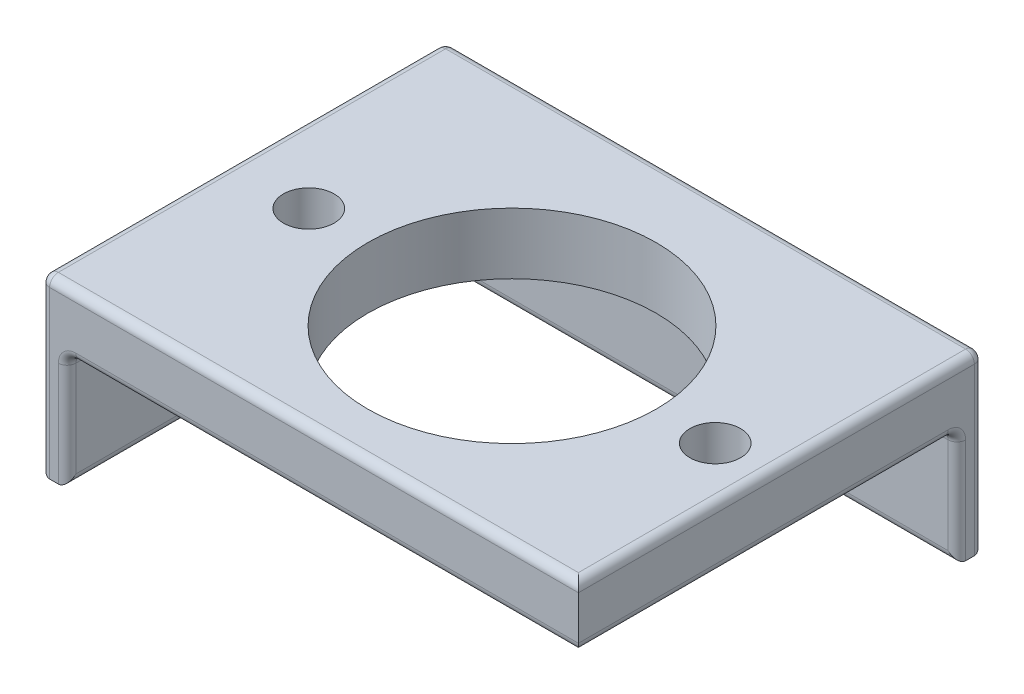
ISO-10303-21;
HEADER;
FILE_DESCRIPTION(('STEP AP214'),'2;1');
FILE_NAME('part.step','',(''),(''),'','','');
FILE_SCHEMA(('AUTOMOTIVE_DESIGN { 1 0 10303 214 1 1 1 1 }'));
ENDSEC;
DATA;
#1=APPLICATION_CONTEXT('core data for automotive mechanical design processes');
#2=APPLICATION_PROTOCOL_DEFINITION('international standard','automotive_design',2000,#1);
#3=PRODUCT_CONTEXT('',#1,'mechanical');
#4=PRODUCT('Part','Part','',(#3));
#5=PRODUCT_RELATED_PRODUCT_CATEGORY('part','',(#4));
#6=PRODUCT_DEFINITION_FORMATION('','',#4);
#7=PRODUCT_DEFINITION_CONTEXT('part definition',#1,'design');
#8=PRODUCT_DEFINITION('design','',#6,#7);
#9=PRODUCT_DEFINITION_SHAPE('','',#8);
#10=(LENGTH_UNIT() NAMED_UNIT(*) SI_UNIT(.MILLI.,.METRE.));
#11=(NAMED_UNIT(*) PLANE_ANGLE_UNIT() SI_UNIT($,.RADIAN.));
#12=(NAMED_UNIT(*) SI_UNIT($,.STERADIAN.) SOLID_ANGLE_UNIT());
#13=UNCERTAINTY_MEASURE_WITH_UNIT(LENGTH_MEASURE(1.E-05),#10,'distance_accuracy_value','');
#14=(GEOMETRIC_REPRESENTATION_CONTEXT(3) GLOBAL_UNCERTAINTY_ASSIGNED_CONTEXT((#13)) GLOBAL_UNIT_ASSIGNED_CONTEXT((#10,
#11,#12)) REPRESENTATION_CONTEXT('',''));
#15=CARTESIAN_POINT('',(0.,0.,0.));
#16=DIRECTION('',(0.,0.,1.));
#17=DIRECTION('',(1.,0.,0.));
#18=AXIS2_PLACEMENT_3D('',#15,#16,#17);
#19=CARTESIAN_POINT('',(-29.25,0.,0.));
#20=DIRECTION('',(-1.,0.,0.));
#21=DIRECTION('',(0.,0.,1.));
#22=AXIS2_PLACEMENT_3D('',#19,#20,#21);
#23=PLANE('',#22);
#24=DIRECTION('',(0.,1.,0.));
#25=VECTOR('',#24,1.);
#26=CARTESIAN_POINT('',(-29.25,0.,20.65));
#27=LINE('',#26,#25);
#28=CARTESIAN_POINT('',(-29.25,-1.,20.65));
#29=VERTEX_POINT('',#28);
#30=CARTESIAN_POINT('',(-29.25,-11.98,20.65));
#31=VERTEX_POINT('',#30);
#32=EDGE_CURVE('E387',#29,#31,#27,.F.);
#33=ORIENTED_EDGE('',*,*,#32,.T.);
#34=DIRECTION('',(0.,0.,1.));
#35=VECTOR('',#34,1.);
#36=CARTESIAN_POINT('',(-29.25,-11.98,0.));
#37=LINE('',#36,#35);
#38=CARTESIAN_POINT('',(-29.25,-11.98,-20.65));
#39=VERTEX_POINT('',#38);
#40=EDGE_CURVE('E209',#31,#39,#37,.F.);
#41=ORIENTED_EDGE('',*,*,#40,.T.);
#42=DIRECTION('',(0.,1.,0.));
#43=VECTOR('',#42,1.);
#44=CARTESIAN_POINT('',(-29.25,0.,-20.65));
#45=LINE('',#44,#43);
#46=CARTESIAN_POINT('',(-29.25,-1.,-20.65));
#47=VERTEX_POINT('',#46);
#48=EDGE_CURVE('E384',#39,#47,#45,.T.);
#49=ORIENTED_EDGE('',*,*,#48,.T.);
#50=DIRECTION('',(0.,0.,1.));
#51=VECTOR('',#50,1.);
#52=CARTESIAN_POINT('',(-29.25,-1.,21.65));
#53=LINE('',#52,#51);
#54=EDGE_CURVE('E386',#47,#29,#53,.T.);
#55=ORIENTED_EDGE('',*,*,#54,.T.);
#56=EDGE_LOOP('',(#33,#41,#49,#55));
#57=FACE_BOUND('',#56,.T.);
#58=CARTESIAN_POINT('',(-29.25,-4.79,-11.65));
#59=DIRECTION('',(1.,0.,0.));
#60=DIRECTION('',(0.,0.,-1.));
#61=AXIS2_PLACEMENT_3D('',#58,#59,#60);
#62=CIRCLE('',#61,2.74999999999999);
#63=CARTESIAN_POINT('',(-29.25,-4.79,-14.4));
#64=VERTEX_POINT('',#63);
#65=EDGE_CURVE('E444',#64,#64,#62,.T.);
#66=ORIENTED_EDGE('',*,*,#65,.F.);
#67=EDGE_LOOP('',(#66));
#68=FACE_BOUND('',#67,.T.);
#69=CARTESIAN_POINT('',(-29.25,-4.79,11.65));
#70=DIRECTION('',(1.,0.,0.));
#71=DIRECTION('',(0.,0.,-1.));
#72=AXIS2_PLACEMENT_3D('',#69,#70,#71);
#73=CIRCLE('',#72,2.74999999999999);
#74=CARTESIAN_POINT('',(-29.25,-4.79,8.90000000000001));
#75=VERTEX_POINT('',#74);
#76=EDGE_CURVE('E238',#75,#75,#73,.T.);
#77=ORIENTED_EDGE('',*,*,#76,.F.);
#78=EDGE_LOOP('',(#77));
#79=FACE_BOUND('',#78,.T.);
#80=ADVANCED_FACE('F39',(#57,#68,#79),#23,.F.);
#81=CARTESIAN_POINT('',(0.,7.,0.));
#82=DIRECTION('',(0.,1.,0.));
#83=DIRECTION('',(0.,0.,1.));
#84=AXIS2_PLACEMENT_3D('',#81,#82,#83);
#85=PLANE('',#84);
#86=DIRECTION('',(0.,0.,-1.));
#87=VECTOR('',#86,1.);
#88=CARTESIAN_POINT('',(28.25,7.,-24.65));
#89=LINE('',#88,#87);
#90=CARTESIAN_POINT('',(28.25,7.,20.65));
#91=VERTEX_POINT('',#90);
#92=CARTESIAN_POINT('',(28.25,7.,-23.65));
#93=VERTEX_POINT('',#92);
#94=EDGE_CURVE('E253',#91,#93,#89,.T.);
#95=ORIENTED_EDGE('',*,*,#94,.T.);
#96=DIRECTION('',(1.,0.,0.));
#97=VECTOR('',#96,1.);
#98=CARTESIAN_POINT('',(-32.25,7.,-23.65));
#99=LINE('',#98,#97);
#100=CARTESIAN_POINT('',(-31.25,7.,-23.65));
#101=VERTEX_POINT('',#100);
#102=EDGE_CURVE('E259',#93,#101,#99,.F.);
#103=ORIENTED_EDGE('',*,*,#102,.T.);
#104=DIRECTION('',(0.,0.,-1.));
#105=VECTOR('',#104,1.);
#106=CARTESIAN_POINT('',(-31.25,7.,0.));
#107=LINE('',#106,#105);
#108=CARTESIAN_POINT('',(-31.25,7.,20.65));
#109=VERTEX_POINT('',#108);
#110=EDGE_CURVE('E257',#101,#109,#107,.F.);
#111=ORIENTED_EDGE('',*,*,#110,.T.);
#112=DIRECTION('',(1.,0.,0.));
#113=VECTOR('',#112,1.);
#114=CARTESIAN_POINT('',(29.25,7.,20.65));
#115=LINE('',#114,#113);
#116=EDGE_CURVE('E255',#109,#91,#115,.T.);
#117=ORIENTED_EDGE('',*,*,#116,.T.);
#118=EDGE_LOOP('',(#95,#103,#111,#117));
#119=FACE_BOUND('',#118,.T.);
#120=CARTESIAN_POINT('',(-23.25,7.,0.));
#121=DIRECTION('',(0.,1.,0.));
#122=DIRECTION('',(0.,0.,1.));
#123=AXIS2_PLACEMENT_3D('',#120,#121,#122);
#124=CIRCLE('',#123,2.9);
#125=CARTESIAN_POINT('',(-23.25,7.,2.90000000000001));
#126=VERTEX_POINT('',#125);
#127=EDGE_CURVE('E426',#126,#126,#124,.T.);
#128=ORIENTED_EDGE('',*,*,#127,.F.);
#129=EDGE_LOOP('',(#128));
#130=FACE_BOUND('',#129,.T.);
#131=CARTESIAN_POINT('',(23.25,7.,0.));
#132=DIRECTION('',(0.,1.,0.));
#133=DIRECTION('',(0.,0.,1.));
#134=AXIS2_PLACEMENT_3D('',#131,#132,#133);
#135=CIRCLE('',#134,2.9);
#136=CARTESIAN_POINT('',(23.25,7.,2.9));
#137=VERTEX_POINT('',#136);
#138=EDGE_CURVE('E420',#137,#137,#135,.T.);
#139=ORIENTED_EDGE('',*,*,#138,.F.);
#140=EDGE_LOOP('',(#139));
#141=FACE_BOUND('',#140,.T.);
#142=CARTESIAN_POINT('',(0.,7.,0.));
#143=DIRECTION('',(0.,1.,0.));
#144=DIRECTION('',(0.,0.,1.));
#145=AXIS2_PLACEMENT_3D('',#142,#143,#144);
#146=CIRCLE('',#145,16.5);
#147=CARTESIAN_POINT('',(0.,7.,16.5));
#148=VERTEX_POINT('',#147);
#149=EDGE_CURVE('E411',#148,#148,#146,.T.);
#150=ORIENTED_EDGE('',*,*,#149,.F.);
#151=EDGE_LOOP('',(#150));
#152=FACE_BOUND('',#151,.T.);
#153=ADVANCED_FACE('F457',(#119,#130,#141,#152),#85,.T.);
#154=CARTESIAN_POINT('',(0.,0.,0.));
#155=DIRECTION('',(0.,1.,0.));
#156=DIRECTION('',(0.,0.,1.));
#157=AXIS2_PLACEMENT_3D('',#154,#155,#156);
#158=PLANE('',#157);
#159=DIRECTION('',(-1.,0.,0.));
#160=VECTOR('',#159,1.);
#161=CARTESIAN_POINT('',(0.,0.,-20.65));
#162=LINE('',#161,#160);
#163=CARTESIAN_POINT('',(-28.25,0.,-20.65));
#164=VERTEX_POINT('',#163);
#165=CARTESIAN_POINT('',(28.25,0.,-20.65));
#166=VERTEX_POINT('',#165);
#167=EDGE_CURVE('E355',#164,#166,#162,.F.);
#168=ORIENTED_EDGE('',*,*,#167,.T.);
#169=DIRECTION('',(0.,0.,-1.));
#170=VECTOR('',#169,1.);
#171=CARTESIAN_POINT('',(28.25,0.,0.));
#172=LINE('',#171,#170);
#173=CARTESIAN_POINT('',(28.25,0.,20.65));
#174=VERTEX_POINT('',#173);
#175=EDGE_CURVE('E378',#166,#174,#172,.F.);
#176=ORIENTED_EDGE('',*,*,#175,.T.);
#177=DIRECTION('',(1.,0.,0.));
#178=VECTOR('',#177,1.);
#179=CARTESIAN_POINT('',(0.,0.,20.65));
#180=LINE('',#179,#178);
#181=CARTESIAN_POINT('',(-28.25,0.,20.65));
#182=VERTEX_POINT('',#181);
#183=EDGE_CURVE('E376',#174,#182,#180,.F.);
#184=ORIENTED_EDGE('',*,*,#183,.T.);
#185=DIRECTION('',(0.,0.,1.));
#186=VECTOR('',#185,1.);
#187=CARTESIAN_POINT('',(-28.25,0.,-21.65));
#188=LINE('',#187,#186);
#189=EDGE_CURVE('E374',#182,#164,#188,.F.);
#190=ORIENTED_EDGE('',*,*,#189,.T.);
#191=EDGE_LOOP('',(#168,#176,#184,#190));
#192=FACE_BOUND('',#191,.T.);
#193=CARTESIAN_POINT('',(-23.25,0.,0.));
#194=DIRECTION('',(0.,1.,0.));
#195=DIRECTION('',(0.,0.,1.));
#196=AXIS2_PLACEMENT_3D('',#193,#194,#195);
#197=CIRCLE('',#196,2.9);
#198=CARTESIAN_POINT('',(-23.25,0.,2.9));
#199=VERTEX_POINT('',#198);
#200=EDGE_CURVE('E423',#199,#199,#197,.T.);
#201=ORIENTED_EDGE('',*,*,#200,.T.);
#202=EDGE_LOOP('',(#201));
#203=FACE_BOUND('',#202,.T.);
#204=CARTESIAN_POINT('',(23.25,0.,0.));
#205=DIRECTION('',(0.,1.,0.));
#206=DIRECTION('',(0.,0.,1.));
#207=AXIS2_PLACEMENT_3D('',#204,#205,#206);
#208=CIRCLE('',#207,2.9);
#209=CARTESIAN_POINT('',(23.25,0.,2.9));
#210=VERTEX_POINT('',#209);
#211=EDGE_CURVE('E415',#210,#210,#208,.T.);
#212=ORIENTED_EDGE('',*,*,#211,.T.);
#213=EDGE_LOOP('',(#212));
#214=FACE_BOUND('',#213,.T.);
#215=CARTESIAN_POINT('',(0.,0.,0.));
#216=DIRECTION('',(0.,1.,0.));
#217=DIRECTION('',(0.,0.,1.));
#218=AXIS2_PLACEMENT_3D('',#215,#216,#217);
#219=CIRCLE('',#218,16.5);
#220=CARTESIAN_POINT('',(0.,0.,16.5));
#221=VERTEX_POINT('',#220);
#222=EDGE_CURVE('E412',#221,#221,#219,.T.);
#223=ORIENTED_EDGE('',*,*,#222,.T.);
#224=EDGE_LOOP('',(#223));
#225=FACE_BOUND('',#224,.T.);
#226=ADVANCED_FACE('F462',(#192,#203,#214,#225),#158,.F.);
#227=CARTESIAN_POINT('',(29.25,7.,21.65));
#228=DIRECTION('',(0.,0.,-1.));
#229=DIRECTION('',(-1.,0.,0.));
#230=AXIS2_PLACEMENT_3D('',#227,#228,#229);
#231=PLANE('',#230);
#232=DIRECTION('',(1.,0.,0.));
#233=VECTOR('',#232,1.);
#234=CARTESIAN_POINT('',(-32.25,6.,21.65));
#235=LINE('',#234,#233);
#236=CARTESIAN_POINT('',(29.25,6.,21.65));
#237=VERTEX_POINT('',#236);
#238=CARTESIAN_POINT('',(-31.25,6.,21.65));
#239=VERTEX_POINT('',#238);
#240=EDGE_CURVE('E48',#237,#239,#235,.F.);
#241=ORIENTED_EDGE('',*,*,#240,.T.);
#242=DIRECTION('',(0.,1.,0.));
#243=VECTOR('',#242,1.);
#244=CARTESIAN_POINT('',(-31.25,-12.98,21.65));
#245=LINE('',#244,#243);
#246=CARTESIAN_POINT('',(-31.25,-12.98,21.65));
#247=VERTEX_POINT('',#246);
#248=EDGE_CURVE('E11',#239,#247,#245,.F.);
#249=ORIENTED_EDGE('',*,*,#248,.T.);
#250=DIRECTION('',(1.,0.,0.));
#251=VECTOR('',#250,1.);
#252=CARTESIAN_POINT('',(-32.25,-12.98,21.65));
#253=LINE('',#252,#251);
#254=CARTESIAN_POINT('',(-30.25,-12.98,21.65));
#255=VERTEX_POINT('',#254);
#256=EDGE_CURVE('E172',#247,#255,#253,.T.);
#257=ORIENTED_EDGE('',*,*,#256,.T.);
#258=DIRECTION('',(0.,1.,0.));
#259=VECTOR('',#258,1.);
#260=CARTESIAN_POINT('',(-30.25,7.,21.65));
#261=LINE('',#260,#259);
#262=CARTESIAN_POINT('',(-30.25,-1.,21.65));
#263=VERTEX_POINT('',#262);
#264=EDGE_CURVE('E176',#255,#263,#261,.T.);
#265=ORIENTED_EDGE('',*,*,#264,.T.);
#266=CARTESIAN_POINT('',(-28.25,-1.,21.65));
#267=DIRECTION('',(0.,0.,-1.));
#268=DIRECTION('',(-1.,0.,0.));
#269=AXIS2_PLACEMENT_3D('',#266,#267,#268);
#270=CIRCLE('',#269,2.);
#271=CARTESIAN_POINT('',(-28.25,1.,21.65));
#272=VERTEX_POINT('',#271);
#273=EDGE_CURVE('E205',#272,#263,#270,.F.);
#274=ORIENTED_EDGE('',*,*,#273,.F.);
#275=DIRECTION('',(1.,0.,0.));
#276=VECTOR('',#275,1.);
#277=CARTESIAN_POINT('',(29.25,1.,21.65));
#278=LINE('',#277,#276);
#279=CARTESIAN_POINT('',(29.25,1.,21.65));
#280=VERTEX_POINT('',#279);
#281=EDGE_CURVE('E204',#272,#280,#278,.T.);
#282=ORIENTED_EDGE('',*,*,#281,.T.);
#283=DIRECTION('',(0.,-1.,0.));
#284=VECTOR('',#283,1.);
#285=CARTESIAN_POINT('',(29.25,7.,21.65));
#286=LINE('',#285,#284);
#287=EDGE_CURVE('E193',#237,#280,#286,.T.);
#288=ORIENTED_EDGE('',*,*,#287,.F.);
#289=EDGE_LOOP('',(#241,#249,#257,#265,#274,#282,#288));
#290=FACE_BOUND('',#289,.T.);
#291=ADVANCED_FACE('F174',(#290),#231,.F.);
#292=CARTESIAN_POINT('',(29.25,7.,21.65));
#293=DIRECTION('',(-1.,0.,0.));
#294=DIRECTION('',(0.,0.,1.));
#295=AXIS2_PLACEMENT_3D('',#292,#293,#294);
#296=PLANE('',#295);
#297=DIRECTION('',(0.,0.,1.));
#298=VECTOR('',#297,1.);
#299=CARTESIAN_POINT('',(29.25,-12.98,-24.65));
#300=LINE('',#299,#298);
#301=CARTESIAN_POINT('',(29.25,-12.98,-23.65));
#302=VERTEX_POINT('',#301);
#303=CARTESIAN_POINT('',(29.25,-12.98,-22.65));
#304=VERTEX_POINT('',#303);
#305=EDGE_CURVE('E180',#302,#304,#300,.T.);
#306=ORIENTED_EDGE('',*,*,#305,.F.);
#307=DIRECTION('',(0.,-1.,0.));
#308=VECTOR('',#307,1.);
#309=CARTESIAN_POINT('',(29.25,7.,-23.65));
#310=LINE('',#309,#308);
#311=CARTESIAN_POINT('',(29.25,6.,-23.65));
#312=VERTEX_POINT('',#311);
#313=EDGE_CURVE('E250',#302,#312,#310,.F.);
#314=ORIENTED_EDGE('',*,*,#313,.T.);
#315=DIRECTION('',(0.,0.,-1.));
#316=VECTOR('',#315,1.);
#317=CARTESIAN_POINT('',(29.25,6.,21.65));
#318=LINE('',#317,#316);
#319=EDGE_CURVE('E248',#312,#237,#318,.F.);
#320=ORIENTED_EDGE('',*,*,#319,.T.);
#321=ORIENTED_EDGE('',*,*,#287,.T.);
#322=DIRECTION('',(0.,0.,-1.));
#323=VECTOR('',#322,1.);
#324=CARTESIAN_POINT('',(29.25,1.,21.65));
#325=LINE('',#324,#323);
#326=CARTESIAN_POINT('',(29.25,1.,-20.65));
#327=VERTEX_POINT('',#326);
#328=EDGE_CURVE('E371',#280,#327,#325,.T.);
#329=ORIENTED_EDGE('',*,*,#328,.T.);
#330=CARTESIAN_POINT('',(29.25,-1.,-20.65));
#331=DIRECTION('',(-1.,0.,0.));
#332=DIRECTION('',(0.,0.,1.));
#333=AXIS2_PLACEMENT_3D('',#330,#331,#332);
#334=CIRCLE('',#333,2.);
#335=CARTESIAN_POINT('',(29.25,-1.,-22.65));
#336=VERTEX_POINT('',#335);
#337=EDGE_CURVE('E347',#336,#327,#334,.F.);
#338=ORIENTED_EDGE('',*,*,#337,.F.);
#339=DIRECTION('',(0.,-1.,0.));
#340=VECTOR('',#339,1.);
#341=CARTESIAN_POINT('',(29.25,-12.98,-22.65));
#342=LINE('',#341,#340);
#343=EDGE_CURVE('E343',#336,#304,#342,.T.);
#344=ORIENTED_EDGE('',*,*,#343,.T.);
#345=EDGE_LOOP('',(#306,#314,#320,#321,#329,#338,#344));
#346=FACE_BOUND('',#345,.T.);
#347=ADVANCED_FACE('F487',(#346),#296,.F.);
#348=CARTESIAN_POINT('',(0.,7.,0.));
#349=DIRECTION('',(0.,-1.,0.));
#350=DIRECTION('',(0.,0.,-1.));
#351=AXIS2_PLACEMENT_3D('',#348,#349,#350);
#352=CYLINDRICAL_SURFACE('',#351,16.5);
#353=ORIENTED_EDGE('',*,*,#149,.T.);
#354=EDGE_LOOP('',(#353));
#355=FACE_BOUND('',#354,.T.);
#356=ORIENTED_EDGE('',*,*,#222,.F.);
#357=EDGE_LOOP('',(#356));
#358=FACE_BOUND('',#357,.T.);
#359=ADVANCED_FACE('F484',(#355,#358),#352,.F.);
#360=CARTESIAN_POINT('',(23.25,7.,0.));
#361=DIRECTION('',(0.,1.,0.));
#362=DIRECTION('',(0.,0.,1.));
#363=AXIS2_PLACEMENT_3D('',#360,#361,#362);
#364=CYLINDRICAL_SURFACE('',#363,2.9);
#365=ORIENTED_EDGE('',*,*,#211,.F.);
#366=EDGE_LOOP('',(#365));
#367=FACE_BOUND('',#366,.T.);
#368=ORIENTED_EDGE('',*,*,#138,.T.);
#369=EDGE_LOOP('',(#368));
#370=FACE_BOUND('',#369,.T.);
#371=ADVANCED_FACE('F480',(#367,#370),#364,.F.);
#372=CARTESIAN_POINT('',(-23.25,7.,0.));
#373=DIRECTION('',(0.,1.,0.));
#374=DIRECTION('',(0.,0.,1.));
#375=AXIS2_PLACEMENT_3D('',#372,#373,#374);
#376=CYLINDRICAL_SURFACE('',#375,2.9);
#377=ORIENTED_EDGE('',*,*,#200,.F.);
#378=EDGE_LOOP('',(#377));
#379=FACE_BOUND('',#378,.T.);
#380=ORIENTED_EDGE('',*,*,#127,.T.);
#381=EDGE_LOOP('',(#380));
#382=FACE_BOUND('',#381,.T.);
#383=ADVANCED_FACE('F477',(#379,#382),#376,.F.);
#384=CARTESIAN_POINT('',(-29.25,-12.98,-24.65));
#385=DIRECTION('',(0.,1.,0.));
#386=DIRECTION('',(-1.,0.,0.));
#387=AXIS2_PLACEMENT_3D('',#384,#385,#386);
#388=PLANE('',#387);
#389=DIRECTION('',(0.,0.,1.));
#390=VECTOR('',#389,1.);
#391=CARTESIAN_POINT('',(-31.25,-12.98,-24.65));
#392=LINE('',#391,#390);
#393=CARTESIAN_POINT('',(-31.25,-12.98,-23.65));
#394=VERTEX_POINT('',#393);
#395=EDGE_CURVE('E62',#247,#394,#392,.F.);
#396=ORIENTED_EDGE('',*,*,#395,.T.);
#397=DIRECTION('',(-1.,0.,0.));
#398=VECTOR('',#397,1.);
#399=CARTESIAN_POINT('',(-29.25,-12.98,-23.65));
#400=LINE('',#399,#398);
#401=EDGE_CURVE('E272',#394,#302,#400,.F.);
#402=ORIENTED_EDGE('',*,*,#401,.T.);
#403=ORIENTED_EDGE('',*,*,#305,.T.);
#404=DIRECTION('',(-1.,0.,0.));
#405=VECTOR('',#404,1.);
#406=CARTESIAN_POINT('',(-29.25,-12.98,-22.65));
#407=LINE('',#406,#405);
#408=CARTESIAN_POINT('',(-28.25,-12.98,-22.65));
#409=VERTEX_POINT('',#408);
#410=EDGE_CURVE('E364',#304,#409,#407,.T.);
#411=ORIENTED_EDGE('',*,*,#410,.T.);
#412=CARTESIAN_POINT('',(-28.25,-12.98,-20.65));
#413=DIRECTION('',(0.,1.,0.));
#414=DIRECTION('',(-1.,0.,0.));
#415=AXIS2_PLACEMENT_3D('',#412,#413,#414);
#416=CIRCLE('',#415,2.);
#417=CARTESIAN_POINT('',(-30.25,-12.98,-20.65));
#418=VERTEX_POINT('',#417);
#419=EDGE_CURVE('E188',#418,#409,#416,.F.);
#420=ORIENTED_EDGE('',*,*,#419,.F.);
#421=DIRECTION('',(0.,0.,1.));
#422=VECTOR('',#421,1.);
#423=CARTESIAN_POINT('',(-30.25,-12.98,-24.65));
#424=LINE('',#423,#422);
#425=EDGE_CURVE('E184',#418,#255,#424,.T.);
#426=ORIENTED_EDGE('',*,*,#425,.T.);
#427=ORIENTED_EDGE('',*,*,#256,.F.);
#428=EDGE_LOOP('',(#396,#402,#403,#411,#420,#426,#427));
#429=FACE_BOUND('',#428,.T.);
#430=ADVANCED_FACE('F185',(#429),#388,.F.);
#431=CARTESIAN_POINT('',(0.,0.,-24.65));
#432=DIRECTION('',(0.,0.,1.));
#433=DIRECTION('',(1.,0.,0.));
#434=AXIS2_PLACEMENT_3D('',#431,#432,#433);
#435=PLANE('',#434);
#436=DIRECTION('',(1.,0.,0.));
#437=VECTOR('',#436,1.);
#438=CARTESIAN_POINT('',(29.25,6.,-24.65));
#439=LINE('',#438,#437);
#440=CARTESIAN_POINT('',(-31.25,6.,-24.65));
#441=VERTEX_POINT('',#440);
#442=CARTESIAN_POINT('',(28.25,6.,-24.65));
#443=VERTEX_POINT('',#442);
#444=EDGE_CURVE('E243',#441,#443,#439,.T.);
#445=ORIENTED_EDGE('',*,*,#444,.T.);
#446=DIRECTION('',(0.,-1.,0.));
#447=VECTOR('',#446,1.);
#448=CARTESIAN_POINT('',(28.25,0.,-24.65));
#449=LINE('',#448,#447);
#450=CARTESIAN_POINT('',(28.25,-11.98,-24.65));
#451=VERTEX_POINT('',#450);
#452=EDGE_CURVE('E245',#443,#451,#449,.T.);
#453=ORIENTED_EDGE('',*,*,#452,.T.);
#454=DIRECTION('',(-1.,0.,0.));
#455=VECTOR('',#454,1.);
#456=CARTESIAN_POINT('',(0.,-11.98,-24.65));
#457=LINE('',#456,#455);
#458=CARTESIAN_POINT('',(-31.25,-11.98,-24.65));
#459=VERTEX_POINT('',#458);
#460=EDGE_CURVE('E239',#451,#459,#457,.T.);
#461=ORIENTED_EDGE('',*,*,#460,.T.);
#462=DIRECTION('',(0.,-1.,0.));
#463=VECTOR('',#462,1.);
#464=CARTESIAN_POINT('',(-31.25,7.,-24.65));
#465=LINE('',#464,#463);
#466=EDGE_CURVE('E241',#459,#441,#465,.F.);
#467=ORIENTED_EDGE('',*,*,#466,.T.);
#468=EDGE_LOOP('',(#445,#453,#461,#467));
#469=FACE_BOUND('',#468,.T.);
#470=CARTESIAN_POINT('',(-17.,-4.79000000000001,-24.65));
#471=DIRECTION('',(0.,0.,1.));
#472=DIRECTION('',(1.,0.,0.));
#473=AXIS2_PLACEMENT_3D('',#470,#471,#472);
#474=CIRCLE('',#473,2.75);
#475=CARTESIAN_POINT('',(-14.25,-4.79000000000001,-24.65));
#476=VERTEX_POINT('',#475);
#477=EDGE_CURVE('E435',#476,#476,#474,.T.);
#478=ORIENTED_EDGE('',*,*,#477,.T.);
#479=EDGE_LOOP('',(#478));
#480=FACE_BOUND('',#479,.T.);
#481=CARTESIAN_POINT('',(17.,-4.79,-24.65));
#482=DIRECTION('',(0.,0.,1.));
#483=DIRECTION('',(1.,0.,0.));
#484=AXIS2_PLACEMENT_3D('',#481,#482,#483);
#485=CIRCLE('',#484,2.75);
#486=CARTESIAN_POINT('',(19.75,-4.79,-24.65));
#487=VERTEX_POINT('',#486);
#488=EDGE_CURVE('E181',#487,#487,#485,.T.);
#489=ORIENTED_EDGE('',*,*,#488,.T.);
#490=EDGE_LOOP('',(#489));
#491=FACE_BOUND('',#490,.T.);
#492=ADVANCED_FACE('F469',(#469,#480,#491),#435,.F.);
#493=CARTESIAN_POINT('',(0.,0.,-21.65));
#494=DIRECTION('',(0.,0.,1.));
#495=DIRECTION('',(1.,0.,0.));
#496=AXIS2_PLACEMENT_3D('',#493,#494,#495);
#497=PLANE('',#496);
#498=DIRECTION('',(0.,1.,0.));
#499=VECTOR('',#498,1.);
#500=CARTESIAN_POINT('',(-28.25,0.,-21.65));
#501=LINE('',#500,#499);
#502=CARTESIAN_POINT('',(-28.25,-1.,-21.65));
#503=VERTEX_POINT('',#502);
#504=CARTESIAN_POINT('',(-28.25,-11.98,-21.65));
#505=VERTEX_POINT('',#504);
#506=EDGE_CURVE('E360',#503,#505,#501,.F.);
#507=ORIENTED_EDGE('',*,*,#506,.T.);
#508=DIRECTION('',(-1.,0.,0.));
#509=VECTOR('',#508,1.);
#510=CARTESIAN_POINT('',(29.25,-11.98,-21.65));
#511=LINE('',#510,#509);
#512=CARTESIAN_POINT('',(28.25,-11.98,-21.65));
#513=VERTEX_POINT('',#512);
#514=EDGE_CURVE('E362',#505,#513,#511,.F.);
#515=ORIENTED_EDGE('',*,*,#514,.T.);
#516=DIRECTION('',(0.,-1.,0.));
#517=VECTOR('',#516,1.);
#518=CARTESIAN_POINT('',(28.25,0.,-21.65));
#519=LINE('',#518,#517);
#520=CARTESIAN_POINT('',(28.25,-1.,-21.65));
#521=VERTEX_POINT('',#520);
#522=EDGE_CURVE('E340',#513,#521,#519,.F.);
#523=ORIENTED_EDGE('',*,*,#522,.T.);
#524=DIRECTION('',(-1.,0.,0.));
#525=VECTOR('',#524,1.);
#526=CARTESIAN_POINT('',(0.,-1.,-21.65));
#527=LINE('',#526,#525);
#528=EDGE_CURVE('E357',#521,#503,#527,.T.);
#529=ORIENTED_EDGE('',*,*,#528,.T.);
#530=EDGE_LOOP('',(#507,#515,#523,#529));
#531=FACE_BOUND('',#530,.T.);
#532=CARTESIAN_POINT('',(-17.,-4.79000000000001,-21.65));
#533=DIRECTION('',(0.,0.,1.));
#534=DIRECTION('',(1.,0.,0.));
#535=AXIS2_PLACEMENT_3D('',#532,#533,#534);
#536=CIRCLE('',#535,2.75);
#537=CARTESIAN_POINT('',(-14.25,-4.79000000000001,-21.65));
#538=VERTEX_POINT('',#537);
#539=EDGE_CURVE('E438',#538,#538,#536,.T.);
#540=ORIENTED_EDGE('',*,*,#539,.F.);
#541=EDGE_LOOP('',(#540));
#542=FACE_BOUND('',#541,.T.);
#543=CARTESIAN_POINT('',(17.,-4.79,-21.65));
#544=DIRECTION('',(0.,0.,1.));
#545=DIRECTION('',(1.,0.,0.));
#546=AXIS2_PLACEMENT_3D('',#543,#544,#545);
#547=CIRCLE('',#546,2.75);
#548=CARTESIAN_POINT('',(19.75,-4.79,-21.65));
#549=VERTEX_POINT('',#548);
#550=EDGE_CURVE('E432',#549,#549,#547,.T.);
#551=ORIENTED_EDGE('',*,*,#550,.F.);
#552=EDGE_LOOP('',(#551));
#553=FACE_BOUND('',#552,.T.);
#554=ADVANCED_FACE('F402',(#531,#542,#553),#497,.T.);
#555=CARTESIAN_POINT('',(-32.25,0.,0.));
#556=DIRECTION('',(-1.,0.,0.));
#557=DIRECTION('',(0.,0.,1.));
#558=AXIS2_PLACEMENT_3D('',#555,#556,#557);
#559=PLANE('',#558);
#560=DIRECTION('',(0.,0.,-1.));
#561=VECTOR('',#560,1.);
#562=CARTESIAN_POINT('',(-32.25,6.,0.));
#563=LINE('',#562,#561);
#564=CARTESIAN_POINT('',(-32.25,6.,20.65));
#565=VERTEX_POINT('',#564);
#566=CARTESIAN_POINT('',(-32.25,6.,-23.65));
#567=VERTEX_POINT('',#566);
#568=EDGE_CURVE('E266',#565,#567,#563,.T.);
#569=ORIENTED_EDGE('',*,*,#568,.T.);
#570=DIRECTION('',(0.,-1.,0.));
#571=VECTOR('',#570,1.);
#572=CARTESIAN_POINT('',(-32.25,-12.98,-23.65));
#573=LINE('',#572,#571);
#574=CARTESIAN_POINT('',(-32.25,-11.98,-23.65));
#575=VERTEX_POINT('',#574);
#576=EDGE_CURVE('E268',#567,#575,#573,.T.);
#577=ORIENTED_EDGE('',*,*,#576,.T.);
#578=DIRECTION('',(0.,0.,1.));
#579=VECTOR('',#578,1.);
#580=CARTESIAN_POINT('',(-32.25,-11.98,21.65));
#581=LINE('',#580,#579);
#582=CARTESIAN_POINT('',(-32.25,-11.98,20.65));
#583=VERTEX_POINT('',#582);
#584=EDGE_CURVE('E262',#575,#583,#581,.T.);
#585=ORIENTED_EDGE('',*,*,#584,.T.);
#586=DIRECTION('',(0.,1.,0.));
#587=VECTOR('',#586,1.);
#588=CARTESIAN_POINT('',(-32.25,7.,20.65));
#589=LINE('',#588,#587);
#590=EDGE_CURVE('E264',#583,#565,#589,.T.);
#591=ORIENTED_EDGE('',*,*,#590,.T.);
#592=EDGE_LOOP('',(#569,#577,#585,#591));
#593=FACE_BOUND('',#592,.T.);
#594=CARTESIAN_POINT('',(-32.25,-4.79,11.65));
#595=DIRECTION('',(-1.,0.,0.));
#596=DIRECTION('',(0.,0.,1.));
#597=AXIS2_PLACEMENT_3D('',#594,#595,#596);
#598=CIRCLE('',#597,2.74999999999999);
#599=CARTESIAN_POINT('',(-32.25,-4.79,14.4));
#600=VERTEX_POINT('',#599);
#601=EDGE_CURVE('E447',#600,#600,#598,.T.);
#602=ORIENTED_EDGE('',*,*,#601,.F.);
#603=EDGE_LOOP('',(#602));
#604=FACE_BOUND('',#603,.T.);
#605=CARTESIAN_POINT('',(-32.25,-4.79,-11.65));
#606=DIRECTION('',(-1.,0.,0.));
#607=DIRECTION('',(0.,0.,1.));
#608=AXIS2_PLACEMENT_3D('',#605,#606,#607);
#609=CIRCLE('',#608,2.74999999999999);
#610=CARTESIAN_POINT('',(-32.25,-4.79,-8.90000000000001));
#611=VERTEX_POINT('',#610);
#612=EDGE_CURVE('E441',#611,#611,#609,.T.);
#613=ORIENTED_EDGE('',*,*,#612,.F.);
#614=EDGE_LOOP('',(#613));
#615=FACE_BOUND('',#614,.T.);
#616=ADVANCED_FACE('F467',(#593,#604,#615),#559,.T.);
#617=CARTESIAN_POINT('',(17.,-4.79,-21.65));
#618=DIRECTION('',(0.,0.,1.));
#619=DIRECTION('',(1.,0.,0.));
#620=AXIS2_PLACEMENT_3D('',#617,#618,#619);
#621=CYLINDRICAL_SURFACE('',#620,2.75);
#622=ORIENTED_EDGE('',*,*,#488,.F.);
#623=EDGE_LOOP('',(#622));
#624=FACE_BOUND('',#623,.T.);
#625=ORIENTED_EDGE('',*,*,#550,.T.);
#626=EDGE_LOOP('',(#625));
#627=FACE_BOUND('',#626,.T.);
#628=ADVANCED_FACE('F630',(#624,#627),#621,.F.);
#629=CARTESIAN_POINT('',(-17.,-4.79000000000001,-21.65));
#630=DIRECTION('',(0.,0.,1.));
#631=DIRECTION('',(1.,0.,0.));
#632=AXIS2_PLACEMENT_3D('',#629,#630,#631);
#633=CYLINDRICAL_SURFACE('',#632,2.75);
#634=ORIENTED_EDGE('',*,*,#477,.F.);
#635=EDGE_LOOP('',(#634));
#636=FACE_BOUND('',#635,.T.);
#637=ORIENTED_EDGE('',*,*,#539,.T.);
#638=EDGE_LOOP('',(#637));
#639=FACE_BOUND('',#638,.T.);
#640=ADVANCED_FACE('F633',(#636,#639),#633,.F.);
#641=CARTESIAN_POINT('',(-29.25,-4.79,-11.65));
#642=DIRECTION('',(1.,0.,0.));
#643=DIRECTION('',(0.,0.,-1.));
#644=AXIS2_PLACEMENT_3D('',#641,#642,#643);
#645=CYLINDRICAL_SURFACE('',#644,2.74999999999999);
#646=ORIENTED_EDGE('',*,*,#65,.T.);
#647=EDGE_LOOP('',(#646));
#648=FACE_BOUND('',#647,.T.);
#649=ORIENTED_EDGE('',*,*,#612,.T.);
#650=EDGE_LOOP('',(#649));
#651=FACE_BOUND('',#650,.T.);
#652=ADVANCED_FACE('F640',(#648,#651),#645,.F.);
#653=CARTESIAN_POINT('',(-29.25,-4.79,11.65));
#654=DIRECTION('',(1.,0.,0.));
#655=DIRECTION('',(0.,0.,-1.));
#656=AXIS2_PLACEMENT_3D('',#653,#654,#655);
#657=CYLINDRICAL_SURFACE('',#656,2.74999999999999);
#658=ORIENTED_EDGE('',*,*,#76,.T.);
#659=EDGE_LOOP('',(#658));
#660=FACE_BOUND('',#659,.T.);
#661=ORIENTED_EDGE('',*,*,#601,.T.);
#662=EDGE_LOOP('',(#661));
#663=FACE_BOUND('',#662,.T.);
#664=ADVANCED_FACE('F453',(#660,#663),#657,.F.);
#665=CARTESIAN_POINT('',(29.25,1.,20.65));
#666=DIRECTION('',(1.,0.,0.));
#667=DIRECTION('',(0.,0.,-1.));
#668=AXIS2_PLACEMENT_3D('',#665,#666,#667);
#669=CYLINDRICAL_SURFACE('',#668,1.);
#670=CARTESIAN_POINT('',(28.25,1.,20.65));
#671=DIRECTION('',(0.707106781186547,0.,-0.707106781186548));
#672=DIRECTION('',(0.707106781186548,0.,0.707106781186547));
#673=AXIS2_PLACEMENT_3D('',#670,#671,#672);
#674=ELLIPSE('',#673,1.41421356237309,1.);
#675=EDGE_CURVE('E230',#280,#174,#674,.T.);
#676=ORIENTED_EDGE('',*,*,#675,.F.);
#677=ORIENTED_EDGE('',*,*,#281,.F.);
#678=CARTESIAN_POINT('',(-28.25,1.,20.65));
#679=DIRECTION('',(-1.,0.,0.));
#680=DIRECTION('',(0.,0.,1.));
#681=AXIS2_PLACEMENT_3D('',#678,#679,#680);
#682=CIRCLE('',#681,1.);
#683=EDGE_CURVE('E235',#182,#272,#682,.T.);
#684=ORIENTED_EDGE('',*,*,#683,.F.);
#685=ORIENTED_EDGE('',*,*,#183,.F.);
#686=EDGE_LOOP('',(#676,#677,#684,#685));
#687=FACE_BOUND('',#686,.T.);
#688=ADVANCED_FACE('F525',(#687),#669,.T.);
#689=CARTESIAN_POINT('',(-28.25,-1.,20.65));
#690=DIRECTION('',(0.,0.,-1.));
#691=DIRECTION('',(-1.,0.,0.));
#692=AXIS2_PLACEMENT_3D('',#689,#690,#691);
#693=TOROIDAL_SURFACE('',#692,2.,1.);
#694=CARTESIAN_POINT('',(-30.25,-1.,20.65));
#695=DIRECTION('',(0.,1.,0.));
#696=DIRECTION('',(0.,0.,1.));
#697=AXIS2_PLACEMENT_3D('',#694,#695,#696);
#698=CIRCLE('',#697,1.);
#699=EDGE_CURVE('E203',#29,#263,#698,.F.);
#700=ORIENTED_EDGE('',*,*,#699,.F.);
#701=CARTESIAN_POINT('',(-28.25,-1.,20.65));
#702=DIRECTION('',(0.,0.,-1.));
#703=DIRECTION('',(-1.,0.,0.));
#704=AXIS2_PLACEMENT_3D('',#701,#702,#703);
#705=CIRCLE('',#704,1.);
#706=EDGE_CURVE('E232',#182,#29,#705,.F.);
#707=ORIENTED_EDGE('',*,*,#706,.F.);
#708=ORIENTED_EDGE('',*,*,#683,.T.);
#709=ORIENTED_EDGE('',*,*,#273,.T.);
#710=EDGE_LOOP('',(#700,#707,#708,#709));
#711=FACE_BOUND('',#710,.T.);
#712=ADVANCED_FACE('F522',(#711),#693,.T.);
#713=CARTESIAN_POINT('',(-28.25,-1.,0.));
#714=DIRECTION('',(0.,0.,-1.));
#715=DIRECTION('',(-1.,0.,0.));
#716=AXIS2_PLACEMENT_3D('',#713,#714,#715);
#717=CYLINDRICAL_SURFACE('',#716,1.);
#718=ORIENTED_EDGE('',*,*,#706,.T.);
#719=ORIENTED_EDGE('',*,*,#54,.F.);
#720=CARTESIAN_POINT('',(-28.25,-1.,-20.65));
#721=DIRECTION('',(0.,0.,1.));
#722=DIRECTION('',(1.,0.,0.));
#723=AXIS2_PLACEMENT_3D('',#720,#721,#722);
#724=CIRCLE('',#723,1.);
#725=EDGE_CURVE('E226',#164,#47,#724,.T.);
#726=ORIENTED_EDGE('',*,*,#725,.F.);
#727=ORIENTED_EDGE('',*,*,#189,.F.);
#728=EDGE_LOOP('',(#718,#719,#726,#727));
#729=FACE_BOUND('',#728,.T.);
#730=ADVANCED_FACE('F395',(#729),#717,.F.);
#731=CARTESIAN_POINT('',(0.,-1.,-20.65));
#732=DIRECTION('',(-1.,0.,0.));
#733=DIRECTION('',(0.,0.,1.));
#734=AXIS2_PLACEMENT_3D('',#731,#732,#733);
#735=CYLINDRICAL_SURFACE('',#734,1.);
#736=CARTESIAN_POINT('',(28.25,-1.,-20.65));
#737=DIRECTION('',(-1.,0.,0.));
#738=DIRECTION('',(0.,0.,1.));
#739=AXIS2_PLACEMENT_3D('',#736,#737,#738);
#740=CIRCLE('',#739,1.);
#741=EDGE_CURVE('E214',#166,#521,#740,.T.);
#742=ORIENTED_EDGE('',*,*,#741,.F.);
#743=ORIENTED_EDGE('',*,*,#167,.F.);
#744=CARTESIAN_POINT('',(-28.25,-1.,-20.65));
#745=DIRECTION('',(1.,0.,0.));
#746=DIRECTION('',(0.,0.,-1.));
#747=AXIS2_PLACEMENT_3D('',#744,#745,#746);
#748=CIRCLE('',#747,1.);
#749=EDGE_CURVE('E223',#503,#164,#748,.T.);
#750=ORIENTED_EDGE('',*,*,#749,.F.);
#751=ORIENTED_EDGE('',*,*,#528,.F.);
#752=EDGE_LOOP('',(#742,#743,#750,#751));
#753=FACE_BOUND('',#752,.T.);
#754=ADVANCED_FACE('F353',(#753),#735,.F.);
#755=CARTESIAN_POINT('',(28.25,1.,21.65));
#756=DIRECTION('',(0.,0.,-1.));
#757=DIRECTION('',(-1.,0.,0.));
#758=AXIS2_PLACEMENT_3D('',#755,#756,#757);
#759=CYLINDRICAL_SURFACE('',#758,1.);
#760=ORIENTED_EDGE('',*,*,#675,.T.);
#761=ORIENTED_EDGE('',*,*,#175,.F.);
#762=CARTESIAN_POINT('',(28.25,1.,-20.65));
#763=DIRECTION('',(0.,0.,-1.));
#764=DIRECTION('',(-1.,0.,0.));
#765=AXIS2_PLACEMENT_3D('',#762,#763,#764);
#766=CIRCLE('',#765,1.);
#767=EDGE_CURVE('E210',#327,#166,#766,.T.);
#768=ORIENTED_EDGE('',*,*,#767,.F.);
#769=ORIENTED_EDGE('',*,*,#328,.F.);
#770=EDGE_LOOP('',(#760,#761,#768,#769));
#771=FACE_BOUND('',#770,.T.);
#772=ADVANCED_FACE('F514',(#771),#759,.T.);
#773=CARTESIAN_POINT('',(-30.25,7.,20.65));
#774=DIRECTION('',(0.,1.,0.));
#775=DIRECTION('',(0.,0.,1.));
#776=AXIS2_PLACEMENT_3D('',#773,#774,#775);
#777=CYLINDRICAL_SURFACE('',#776,1.);
#778=ORIENTED_EDGE('',*,*,#699,.T.);
#779=ORIENTED_EDGE('',*,*,#264,.F.);
#780=CARTESIAN_POINT('',(-30.25,-11.98,20.65));
#781=DIRECTION('',(0.,0.707106781186547,0.707106781186547));
#782=DIRECTION('',(0.,0.707106781186547,-0.707106781186547));
#783=AXIS2_PLACEMENT_3D('',#780,#781,#782);
#784=ELLIPSE('',#783,1.41421356237309,1.);
#785=EDGE_CURVE('E200',#31,#255,#784,.F.);
#786=ORIENTED_EDGE('',*,*,#785,.F.);
#787=ORIENTED_EDGE('',*,*,#32,.F.);
#788=EDGE_LOOP('',(#778,#779,#786,#787));
#789=FACE_BOUND('',#788,.T.);
#790=ADVANCED_FACE('F198',(#789),#777,.T.);
#791=CARTESIAN_POINT('',(-28.25,-1.,-20.65));
#792=DIRECTION('',(0.,1.,0.));
#793=DIRECTION('',(0.,0.,1.));
#794=AXIS2_PLACEMENT_3D('',#791,#792,#793);
#795=SPHERICAL_SURFACE('',#794,1.);
#796=ORIENTED_EDGE('',*,*,#749,.T.);
#797=ORIENTED_EDGE('',*,*,#725,.T.);
#798=CARTESIAN_POINT('',(-28.25,-1.,-20.65));
#799=DIRECTION('',(0.,-1.,0.));
#800=DIRECTION('',(0.,0.,-1.));
#801=AXIS2_PLACEMENT_3D('',#798,#799,#800);
#802=CIRCLE('',#801,1.);
#803=EDGE_CURVE('E211',#503,#47,#802,.F.);
#804=ORIENTED_EDGE('',*,*,#803,.F.);
#805=EDGE_LOOP('',(#796,#797,#804));
#806=FACE_BOUND('',#805,.T.);
#807=ADVANCED_FACE('F399',(#806),#795,.F.);
#808=CARTESIAN_POINT('',(28.25,-1.,-20.65));
#809=DIRECTION('',(-1.,0.,0.));
#810=DIRECTION('',(0.,0.,1.));
#811=AXIS2_PLACEMENT_3D('',#808,#809,#810);
#812=TOROIDAL_SURFACE('',#811,2.,1.);
#813=ORIENTED_EDGE('',*,*,#767,.T.);
#814=ORIENTED_EDGE('',*,*,#741,.T.);
#815=CARTESIAN_POINT('',(28.25,-1.,-22.65));
#816=DIRECTION('',(0.,1.,0.));
#817=DIRECTION('',(0.,0.,1.));
#818=AXIS2_PLACEMENT_3D('',#815,#816,#817);
#819=CIRCLE('',#818,1.);
#820=EDGE_CURVE('E217',#336,#521,#819,.F.);
#821=ORIENTED_EDGE('',*,*,#820,.F.);
#822=ORIENTED_EDGE('',*,*,#337,.T.);
#823=EDGE_LOOP('',(#813,#814,#821,#822));
#824=FACE_BOUND('',#823,.T.);
#825=ADVANCED_FACE('F346',(#824),#812,.T.);
#826=CARTESIAN_POINT('',(-30.25,-11.98,-24.65));
#827=DIRECTION('',(0.,0.,1.));
#828=DIRECTION('',(0.,-1.,0.));
#829=AXIS2_PLACEMENT_3D('',#826,#827,#828);
#830=CYLINDRICAL_SURFACE('',#829,1.);
#831=ORIENTED_EDGE('',*,*,#785,.T.);
#832=ORIENTED_EDGE('',*,*,#425,.F.);
#833=CARTESIAN_POINT('',(-30.25,-11.98,-20.65));
#834=DIRECTION('',(0.,0.,-1.));
#835=DIRECTION('',(-1.,0.,0.));
#836=AXIS2_PLACEMENT_3D('',#833,#834,#835);
#837=CIRCLE('',#836,1.);
#838=EDGE_CURVE('E332',#39,#418,#837,.T.);
#839=ORIENTED_EDGE('',*,*,#838,.F.);
#840=ORIENTED_EDGE('',*,*,#40,.F.);
#841=EDGE_LOOP('',(#831,#832,#839,#840));
#842=FACE_BOUND('',#841,.T.);
#843=ADVANCED_FACE('F207',(#842),#830,.T.);
#844=CARTESIAN_POINT('',(-28.25,0.,-20.65));
#845=DIRECTION('',(0.,1.,0.));
#846=DIRECTION('',(0.,0.,1.));
#847=AXIS2_PLACEMENT_3D('',#844,#845,#846);
#848=CYLINDRICAL_SURFACE('',#847,1.);
#849=ORIENTED_EDGE('',*,*,#803,.T.);
#850=ORIENTED_EDGE('',*,*,#48,.F.);
#851=CARTESIAN_POINT('',(-28.25,-11.98,-20.65));
#852=DIRECTION('',(0.,1.,0.));
#853=DIRECTION('',(-1.,0.,0.));
#854=AXIS2_PLACEMENT_3D('',#851,#852,#853);
#855=CIRCLE('',#854,1.);
#856=EDGE_CURVE('E326',#505,#39,#855,.T.);
#857=ORIENTED_EDGE('',*,*,#856,.F.);
#858=ORIENTED_EDGE('',*,*,#506,.F.);
#859=EDGE_LOOP('',(#849,#850,#857,#858));
#860=FACE_BOUND('',#859,.T.);
#861=ADVANCED_FACE('F401',(#860),#848,.F.);
#862=CARTESIAN_POINT('',(28.25,7.,-22.65));
#863=DIRECTION('',(0.,1.,0.));
#864=DIRECTION('',(0.,0.,1.));
#865=AXIS2_PLACEMENT_3D('',#862,#863,#864);
#866=CYLINDRICAL_SURFACE('',#865,1.);
#867=ORIENTED_EDGE('',*,*,#820,.T.);
#868=ORIENTED_EDGE('',*,*,#522,.F.);
#869=CARTESIAN_POINT('',(28.25,-11.98,-22.65));
#870=DIRECTION('',(0.707106781186548,0.707106781186547,0.));
#871=DIRECTION('',(-0.707106781186547,0.707106781186548,0.));
#872=AXIS2_PLACEMENT_3D('',#869,#870,#871);
#873=ELLIPSE('',#872,1.4142135623731,1.);
#874=EDGE_CURVE('E320',#304,#513,#873,.F.);
#875=ORIENTED_EDGE('',*,*,#874,.F.);
#876=ORIENTED_EDGE('',*,*,#343,.F.);
#877=EDGE_LOOP('',(#867,#868,#875,#876));
#878=FACE_BOUND('',#877,.T.);
#879=ADVANCED_FACE('F338',(#878),#866,.T.);
#880=CARTESIAN_POINT('',(-28.25,-11.98,-20.65));
#881=DIRECTION('',(0.,1.,0.));
#882=DIRECTION('',(-1.,0.,0.));
#883=AXIS2_PLACEMENT_3D('',#880,#881,#882);
#884=TOROIDAL_SURFACE('',#883,2.,1.);
#885=ORIENTED_EDGE('',*,*,#838,.T.);
#886=ORIENTED_EDGE('',*,*,#419,.T.);
#887=CARTESIAN_POINT('',(-28.25,-11.98,-22.65));
#888=DIRECTION('',(-1.,0.,0.));
#889=DIRECTION('',(0.,0.,1.));
#890=AXIS2_PLACEMENT_3D('',#887,#888,#889);
#891=CIRCLE('',#890,1.);
#892=EDGE_CURVE('E315',#505,#409,#891,.F.);
#893=ORIENTED_EDGE('',*,*,#892,.F.);
#894=ORIENTED_EDGE('',*,*,#856,.T.);
#895=EDGE_LOOP('',(#885,#886,#893,#894));
#896=FACE_BOUND('',#895,.T.);
#897=ADVANCED_FACE('F406',(#896),#884,.T.);
#898=CARTESIAN_POINT('',(-29.25,-11.98,-22.65));
#899=DIRECTION('',(1.,0.,0.));
#900=DIRECTION('',(0.,0.,-1.));
#901=AXIS2_PLACEMENT_3D('',#898,#899,#900);
#902=CYLINDRICAL_SURFACE('',#901,1.);
#903=ORIENTED_EDGE('',*,*,#874,.T.);
#904=ORIENTED_EDGE('',*,*,#514,.F.);
#905=ORIENTED_EDGE('',*,*,#892,.T.);
#906=ORIENTED_EDGE('',*,*,#410,.F.);
#907=EDGE_LOOP('',(#903,#904,#905,#906));
#908=FACE_BOUND('',#907,.T.);
#909=ADVANCED_FACE('F404',(#908),#902,.T.);
#910=CARTESIAN_POINT('',(-31.25,6.,20.65));
#911=DIRECTION('',(-1.,0.,0.));
#912=DIRECTION('',(0.,0.,1.));
#913=AXIS2_PLACEMENT_3D('',#910,#911,#912);
#914=SPHERICAL_SURFACE('',#913,1.);
#915=CARTESIAN_POINT('',(-31.25,6.,20.65));
#916=DIRECTION('',(-1.,0.,0.));
#917=DIRECTION('',(0.,0.,1.));
#918=AXIS2_PLACEMENT_3D('',#915,#916,#917);
#919=CIRCLE('',#918,1.);
#920=EDGE_CURVE('E307',#109,#239,#919,.F.);
#921=ORIENTED_EDGE('',*,*,#920,.F.);
#922=CARTESIAN_POINT('',(-31.25,6.,20.65));
#923=DIRECTION('',(0.,0.,1.));
#924=DIRECTION('',(1.,0.,0.));
#925=AXIS2_PLACEMENT_3D('',#922,#923,#924);
#926=CIRCLE('',#925,1.);
#927=EDGE_CURVE('E43',#565,#109,#926,.F.);
#928=ORIENTED_EDGE('',*,*,#927,.F.);
#929=CARTESIAN_POINT('',(-31.25,6.,20.65));
#930=DIRECTION('',(0.,1.,0.));
#931=DIRECTION('',(0.,0.,1.));
#932=AXIS2_PLACEMENT_3D('',#929,#930,#931);
#933=CIRCLE('',#932,1.);
#934=EDGE_CURVE('E308',#239,#565,#933,.F.);
#935=ORIENTED_EDGE('',*,*,#934,.F.);
#936=EDGE_LOOP('',(#921,#928,#935));
#937=FACE_BOUND('',#936,.T.);
#938=ADVANCED_FACE('F41',(#937),#914,.T.);
#939=CARTESIAN_POINT('',(-31.25,6.,0.));
#940=DIRECTION('',(0.,0.,-1.));
#941=DIRECTION('',(-1.,0.,0.));
#942=AXIS2_PLACEMENT_3D('',#939,#940,#941);
#943=CYLINDRICAL_SURFACE('',#942,1.);
#944=ORIENTED_EDGE('',*,*,#927,.T.);
#945=ORIENTED_EDGE('',*,*,#110,.F.);
#946=CARTESIAN_POINT('',(-31.25,6.,-23.65));
#947=DIRECTION('',(0.,0.,-1.));
#948=DIRECTION('',(-1.,0.,0.));
#949=AXIS2_PLACEMENT_3D('',#946,#947,#948);
#950=CIRCLE('',#949,1.);
#951=EDGE_CURVE('E304',#567,#101,#950,.T.);
#952=ORIENTED_EDGE('',*,*,#951,.F.);
#953=ORIENTED_EDGE('',*,*,#568,.F.);
#954=EDGE_LOOP('',(#944,#945,#952,#953));
#955=FACE_BOUND('',#954,.T.);
#956=ADVANCED_FACE('F572',(#955),#943,.T.);
#957=CARTESIAN_POINT('',(-31.25,0.,20.65));
#958=DIRECTION('',(0.,-1.,0.));
#959=DIRECTION('',(0.,0.,-1.));
#960=AXIS2_PLACEMENT_3D('',#957,#958,#959);
#961=CYLINDRICAL_SURFACE('',#960,1.);
#962=ORIENTED_EDGE('',*,*,#934,.T.);
#963=ORIENTED_EDGE('',*,*,#590,.F.);
#964=CARTESIAN_POINT('',(-31.25,-11.98,20.65));
#965=DIRECTION('',(0.,-0.707106781186547,-0.707106781186547));
#966=DIRECTION('',(0.,0.707106781186547,-0.707106781186547));
#967=AXIS2_PLACEMENT_3D('',#964,#965,#966);
#968=ELLIPSE('',#967,1.41421356237309,1.);
#969=EDGE_CURVE('E298',#247,#583,#968,.T.);
#970=ORIENTED_EDGE('',*,*,#969,.F.);
#971=ORIENTED_EDGE('',*,*,#248,.F.);
#972=EDGE_LOOP('',(#962,#963,#970,#971));
#973=FACE_BOUND('',#972,.T.);
#974=ADVANCED_FACE('F569',(#973),#961,.T.);
#975=CARTESIAN_POINT('',(0.,6.,20.65));
#976=DIRECTION('',(-1.,0.,0.));
#977=DIRECTION('',(0.,0.,1.));
#978=AXIS2_PLACEMENT_3D('',#975,#976,#977);
#979=CYLINDRICAL_SURFACE('',#978,1.);
#980=ORIENTED_EDGE('',*,*,#920,.T.);
#981=ORIENTED_EDGE('',*,*,#240,.F.);
#982=CARTESIAN_POINT('',(28.25,6.,20.65));
#983=DIRECTION('',(-0.707106781186547,0.,0.707106781186548));
#984=DIRECTION('',(0.707106781186548,0.,0.707106781186547));
#985=AXIS2_PLACEMENT_3D('',#982,#983,#984);
#986=ELLIPSE('',#985,1.41421356237309,1.);
#987=EDGE_CURVE('E295',#91,#237,#986,.F.);
#988=ORIENTED_EDGE('',*,*,#987,.F.);
#989=ORIENTED_EDGE('',*,*,#116,.F.);
#990=EDGE_LOOP('',(#980,#981,#988,#989));
#991=FACE_BOUND('',#990,.T.);
#992=ADVANCED_FACE('F565',(#991),#979,.T.);
#993=CARTESIAN_POINT('',(-31.25,6.,-23.65));
#994=DIRECTION('',(-1.,0.,0.));
#995=DIRECTION('',(0.,0.,1.));
#996=AXIS2_PLACEMENT_3D('',#993,#994,#995);
#997=SPHERICAL_SURFACE('',#996,1.);
#998=CARTESIAN_POINT('',(-31.25,6.,-23.65));
#999=DIRECTION('',(-1.,0.,0.));
#1000=DIRECTION('',(0.,0.,1.));
#1001=AXIS2_PLACEMENT_3D('',#998,#999,#1000);
#1002=CIRCLE('',#1001,1.);
#1003=EDGE_CURVE('E293',#441,#101,#1002,.F.);
#1004=ORIENTED_EDGE('',*,*,#1003,.F.);
#1005=CARTESIAN_POINT('',(-31.25,6.,-23.65));
#1006=DIRECTION('',(0.,1.,0.));
#1007=DIRECTION('',(0.,0.,1.));
#1008=AXIS2_PLACEMENT_3D('',#1005,#1006,#1007);
#1009=CIRCLE('',#1008,1.);
#1010=EDGE_CURVE('E301',#567,#441,#1009,.F.);
#1011=ORIENTED_EDGE('',*,*,#1010,.F.);
#1012=ORIENTED_EDGE('',*,*,#951,.T.);
#1013=EDGE_LOOP('',(#1004,#1011,#1012));
#1014=FACE_BOUND('',#1013,.T.);
#1015=ADVANCED_FACE('F561',(#1014),#997,.T.);
#1016=CARTESIAN_POINT('',(-31.25,0.,-23.65));
#1017=DIRECTION('',(0.,1.,0.));
#1018=DIRECTION('',(0.,0.,1.));
#1019=AXIS2_PLACEMENT_3D('',#1016,#1017,#1018);
#1020=CYLINDRICAL_SURFACE('',#1019,1.);
#1021=ORIENTED_EDGE('',*,*,#1010,.T.);
#1022=ORIENTED_EDGE('',*,*,#466,.F.);
#1023=CARTESIAN_POINT('',(-31.25,-11.98,-23.65));
#1024=DIRECTION('',(0.,-1.,0.));
#1025=DIRECTION('',(0.,0.,-1.));
#1026=AXIS2_PLACEMENT_3D('',#1023,#1024,#1025);
#1027=CIRCLE('',#1026,1.);
#1028=EDGE_CURVE('E290',#575,#459,#1027,.T.);
#1029=ORIENTED_EDGE('',*,*,#1028,.F.);
#1030=ORIENTED_EDGE('',*,*,#576,.F.);
#1031=EDGE_LOOP('',(#1021,#1022,#1029,#1030));
#1032=FACE_BOUND('',#1031,.T.);
#1033=ADVANCED_FACE('F557',(#1032),#1020,.T.);
#1034=CARTESIAN_POINT('',(-31.25,-11.98,0.));
#1035=DIRECTION('',(0.,0.,-1.));
#1036=DIRECTION('',(0.,1.,0.));
#1037=AXIS2_PLACEMENT_3D('',#1034,#1035,#1036);
#1038=CYLINDRICAL_SURFACE('',#1037,1.);
#1039=ORIENTED_EDGE('',*,*,#969,.T.);
#1040=ORIENTED_EDGE('',*,*,#584,.F.);
#1041=CARTESIAN_POINT('',(-31.25,-11.98,-23.65));
#1042=DIRECTION('',(0.,0.,-1.));
#1043=DIRECTION('',(-1.,0.,0.));
#1044=AXIS2_PLACEMENT_3D('',#1041,#1042,#1043);
#1045=CIRCLE('',#1044,1.);
#1046=EDGE_CURVE('E288',#394,#575,#1045,.T.);
#1047=ORIENTED_EDGE('',*,*,#1046,.F.);
#1048=ORIENTED_EDGE('',*,*,#395,.F.);
#1049=EDGE_LOOP('',(#1039,#1040,#1047,#1048));
#1050=FACE_BOUND('',#1049,.T.);
#1051=ADVANCED_FACE('F553',(#1050),#1038,.T.);
#1052=CARTESIAN_POINT('',(28.25,6.,0.));
#1053=DIRECTION('',(0.,0.,1.));
#1054=DIRECTION('',(1.,0.,0.));
#1055=AXIS2_PLACEMENT_3D('',#1052,#1053,#1054);
#1056=CYLINDRICAL_SURFACE('',#1055,1.);
#1057=ORIENTED_EDGE('',*,*,#987,.T.);
#1058=ORIENTED_EDGE('',*,*,#319,.F.);
#1059=CARTESIAN_POINT('',(28.25,6.,-23.65));
#1060=DIRECTION('',(0.,0.,-1.));
#1061=DIRECTION('',(-1.,0.,0.));
#1062=AXIS2_PLACEMENT_3D('',#1059,#1060,#1061);
#1063=CIRCLE('',#1062,1.);
#1064=EDGE_CURVE('E285',#93,#312,#1063,.T.);
#1065=ORIENTED_EDGE('',*,*,#1064,.F.);
#1066=ORIENTED_EDGE('',*,*,#94,.F.);
#1067=EDGE_LOOP('',(#1057,#1058,#1065,#1066));
#1068=FACE_BOUND('',#1067,.T.);
#1069=ADVANCED_FACE('F549',(#1068),#1056,.T.);
#1070=CARTESIAN_POINT('',(0.,6.,-23.65));
#1071=DIRECTION('',(-1.,0.,0.));
#1072=DIRECTION('',(0.,0.,1.));
#1073=AXIS2_PLACEMENT_3D('',#1070,#1071,#1072);
#1074=CYLINDRICAL_SURFACE('',#1073,1.);
#1075=ORIENTED_EDGE('',*,*,#1003,.T.);
#1076=ORIENTED_EDGE('',*,*,#102,.F.);
#1077=CARTESIAN_POINT('',(28.25,6.,-23.65));
#1078=DIRECTION('',(1.,0.,0.));
#1079=DIRECTION('',(0.,0.,-1.));
#1080=AXIS2_PLACEMENT_3D('',#1077,#1078,#1079);
#1081=CIRCLE('',#1080,1.);
#1082=EDGE_CURVE('E282',#443,#93,#1081,.T.);
#1083=ORIENTED_EDGE('',*,*,#1082,.F.);
#1084=ORIENTED_EDGE('',*,*,#444,.F.);
#1085=EDGE_LOOP('',(#1075,#1076,#1083,#1084));
#1086=FACE_BOUND('',#1085,.T.);
#1087=ADVANCED_FACE('F545',(#1086),#1074,.T.);
#1088=CARTESIAN_POINT('',(-31.25,-11.98,-23.65));
#1089=DIRECTION('',(-1.,0.,0.));
#1090=DIRECTION('',(0.,0.,1.));
#1091=AXIS2_PLACEMENT_3D('',#1088,#1089,#1090);
#1092=SPHERICAL_SURFACE('',#1091,1.);
#1093=ORIENTED_EDGE('',*,*,#1046,.T.);
#1094=ORIENTED_EDGE('',*,*,#1028,.T.);
#1095=CARTESIAN_POINT('',(-31.25,-11.98,-23.65));
#1096=DIRECTION('',(-1.,0.,0.));
#1097=DIRECTION('',(0.,0.,1.));
#1098=AXIS2_PLACEMENT_3D('',#1095,#1096,#1097);
#1099=CIRCLE('',#1098,1.);
#1100=EDGE_CURVE('E279',#394,#459,#1099,.F.);
#1101=ORIENTED_EDGE('',*,*,#1100,.F.);
#1102=EDGE_LOOP('',(#1093,#1094,#1101));
#1103=FACE_BOUND('',#1102,.T.);
#1104=ADVANCED_FACE('F541',(#1103),#1092,.T.);
#1105=CARTESIAN_POINT('',(28.25,6.,-23.65));
#1106=DIRECTION('',(0.,1.,0.));
#1107=DIRECTION('',(0.,0.,1.));
#1108=AXIS2_PLACEMENT_3D('',#1105,#1106,#1107);
#1109=SPHERICAL_SURFACE('',#1108,1.);
#1110=ORIENTED_EDGE('',*,*,#1082,.T.);
#1111=ORIENTED_EDGE('',*,*,#1064,.T.);
#1112=CARTESIAN_POINT('',(28.25,6.,-23.65));
#1113=DIRECTION('',(0.,1.,0.));
#1114=DIRECTION('',(0.,0.,1.));
#1115=AXIS2_PLACEMENT_3D('',#1112,#1113,#1114);
#1116=CIRCLE('',#1115,1.);
#1117=EDGE_CURVE('E277',#443,#312,#1116,.F.);
#1118=ORIENTED_EDGE('',*,*,#1117,.F.);
#1119=EDGE_LOOP('',(#1110,#1111,#1118));
#1120=FACE_BOUND('',#1119,.T.);
#1121=ADVANCED_FACE('F537',(#1120),#1109,.T.);
#1122=CARTESIAN_POINT('',(0.,-11.98,-23.65));
#1123=DIRECTION('',(-1.,0.,0.));
#1124=DIRECTION('',(0.,0.,1.));
#1125=AXIS2_PLACEMENT_3D('',#1122,#1123,#1124);
#1126=CYLINDRICAL_SURFACE('',#1125,1.);
#1127=ORIENTED_EDGE('',*,*,#1100,.T.);
#1128=ORIENTED_EDGE('',*,*,#460,.F.);
#1129=CARTESIAN_POINT('',(28.25,-11.98,-23.65));
#1130=DIRECTION('',(-0.707106781186548,-0.707106781186547,0.));
#1131=DIRECTION('',(-0.707106781186547,0.707106781186548,0.));
#1132=AXIS2_PLACEMENT_3D('',#1129,#1130,#1131);
#1133=ELLIPSE('',#1132,1.4142135623731,1.);
#1134=EDGE_CURVE('E275',#302,#451,#1133,.F.);
#1135=ORIENTED_EDGE('',*,*,#1134,.F.);
#1136=ORIENTED_EDGE('',*,*,#401,.F.);
#1137=EDGE_LOOP('',(#1127,#1128,#1135,#1136));
#1138=FACE_BOUND('',#1137,.T.);
#1139=ADVANCED_FACE('F533',(#1138),#1126,.T.);
#1140=CARTESIAN_POINT('',(28.25,0.,-23.65));
#1141=DIRECTION('',(0.,-1.,0.));
#1142=DIRECTION('',(0.,0.,-1.));
#1143=AXIS2_PLACEMENT_3D('',#1140,#1141,#1142);
#1144=CYLINDRICAL_SURFACE('',#1143,1.);
#1145=ORIENTED_EDGE('',*,*,#1117,.T.);
#1146=ORIENTED_EDGE('',*,*,#313,.F.);
#1147=ORIENTED_EDGE('',*,*,#1134,.T.);
#1148=ORIENTED_EDGE('',*,*,#452,.F.);
#1149=EDGE_LOOP('',(#1145,#1146,#1147,#1148));
#1150=FACE_BOUND('',#1149,.T.);
#1151=ADVANCED_FACE('F530',(#1150),#1144,.T.);
#1152=CLOSED_SHELL('',(#80,#153,#226,#291,#347,#359,#371,#383,#430,#492,#554,#616,#628,#640,
#652,#664,#688,#712,#730,#754,#772,#790,#807,#825,#843,#861,#879,#897,#909,#938,#956,#974,#992,
#1015,#1033,#1051,#1069,#1087,#1104,#1121,#1139,#1151));
#1153=MANIFOLD_SOLID_BREP('B2',#1152);
#1154=ADVANCED_BREP_SHAPE_REPRESENTATION('',(#18,#1153),#14);
#1155=SHAPE_DEFINITION_REPRESENTATION(#9,#1154);
ENDSEC;
END-ISO-10303-21;
